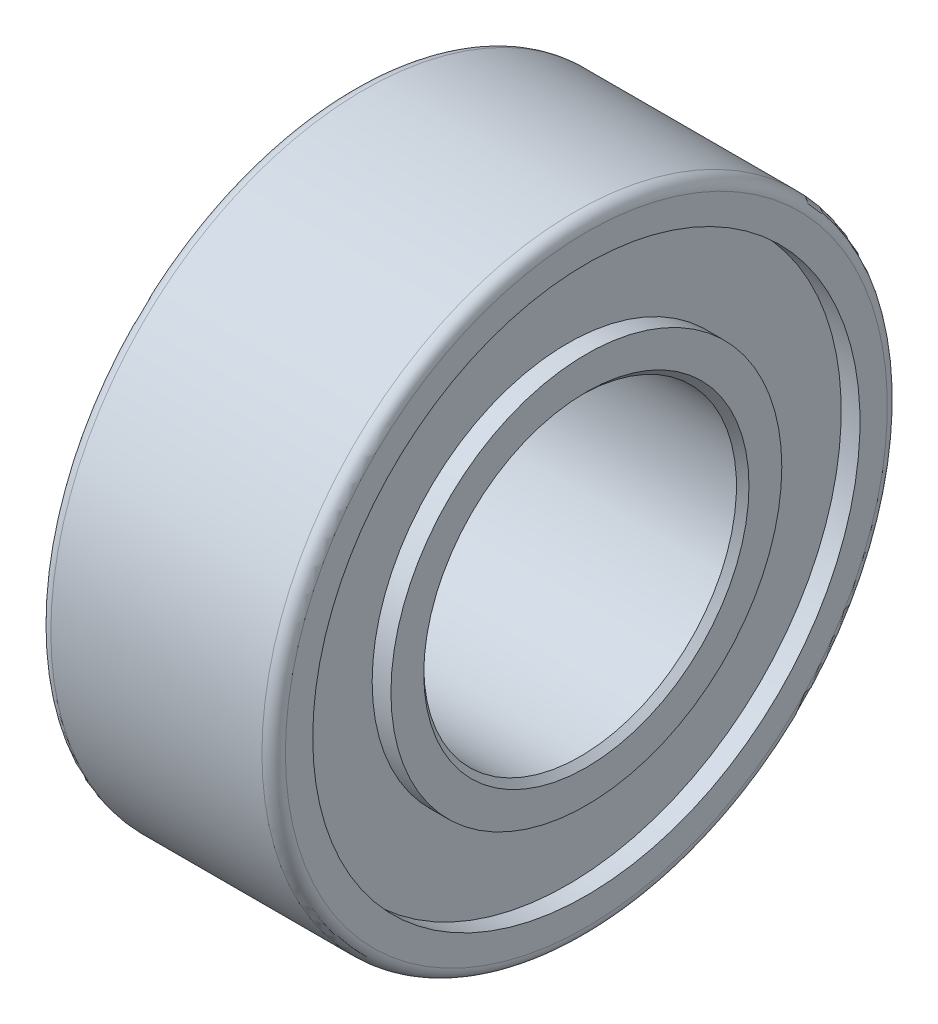
ISO-10303-21;
HEADER;
FILE_DESCRIPTION(('STEP AP214'),'2;1');
FILE_NAME('part.step','',(''),(''),'','','');
FILE_SCHEMA(('AUTOMOTIVE_DESIGN { 1 0 10303 214 1 1 1 1 }'));
ENDSEC;
DATA;
#1=APPLICATION_CONTEXT('core data for automotive mechanical design processes');
#2=APPLICATION_PROTOCOL_DEFINITION('international standard','automotive_design',2000,#1);
#3=PRODUCT_CONTEXT('',#1,'mechanical');
#4=PRODUCT('Part','Part','',(#3));
#5=PRODUCT_RELATED_PRODUCT_CATEGORY('part','',(#4));
#6=PRODUCT_DEFINITION_FORMATION('','',#4);
#7=PRODUCT_DEFINITION_CONTEXT('part definition',#1,'design');
#8=PRODUCT_DEFINITION('design','',#6,#7);
#9=PRODUCT_DEFINITION_SHAPE('','',#8);
#10=(LENGTH_UNIT() NAMED_UNIT(*) SI_UNIT(.MILLI.,.METRE.));
#11=(NAMED_UNIT(*) PLANE_ANGLE_UNIT() SI_UNIT($,.RADIAN.));
#12=(NAMED_UNIT(*) SI_UNIT($,.STERADIAN.) SOLID_ANGLE_UNIT());
#13=UNCERTAINTY_MEASURE_WITH_UNIT(LENGTH_MEASURE(1.E-05),#10,'distance_accuracy_value','');
#14=(GEOMETRIC_REPRESENTATION_CONTEXT(3) GLOBAL_UNCERTAINTY_ASSIGNED_CONTEXT((#13)) GLOBAL_UNIT_ASSIGNED_CONTEXT((#10,
#11,#12)) REPRESENTATION_CONTEXT('',''));
#15=CARTESIAN_POINT('',(0.,0.,0.));
#16=DIRECTION('',(0.,0.,1.));
#17=DIRECTION('',(1.,0.,0.));
#18=AXIS2_PLACEMENT_3D('',#15,#16,#17);
#19=CARTESIAN_POINT('',(2.38125000004175,3.96875,0.));
#20=DIRECTION('',(1.,0.,0.));
#21=DIRECTION('',(0.,0.,-1.));
#22=AXIS2_PLACEMENT_3D('',#19,#20,#21);
#23=PLANE('',#22);
#24=CARTESIAN_POINT('',(2.38125000004175,0.,0.));
#25=DIRECTION('',(-1.,0.,0.));
#26=DIRECTION('',(0.,0.,1.));
#27=AXIS2_PLACEMENT_3D('',#24,#25,#26);
#28=CIRCLE('',#27,3.30200000001923);
#29=CARTESIAN_POINT('',(2.38125000004175,0.,3.30200000001923));
#30=VERTEX_POINT('',#29);
#31=EDGE_CURVE('E10',#30,#30,#28,.T.);
#32=ORIENTED_EDGE('',*,*,#31,.T.);
#33=EDGE_LOOP('',(#32));
#34=FACE_BOUND('',#33,.T.);
#35=CARTESIAN_POINT('',(2.38125000004175,0.,0.));
#36=DIRECTION('',(-1.,0.,0.));
#37=DIRECTION('',(0.,0.,1.));
#38=AXIS2_PLACEMENT_3D('',#35,#36,#37);
#39=CIRCLE('',#38,3.96875);
#40=CARTESIAN_POINT('',(2.38125000004175,0.,3.96875));
#41=VERTEX_POINT('',#40);
#42=EDGE_CURVE('E84',#41,#41,#39,.T.);
#43=ORIENTED_EDGE('',*,*,#42,.F.);
#44=EDGE_LOOP('',(#43));
#45=FACE_BOUND('',#44,.T.);
#46=ADVANCED_FACE('F32',(#34,#45),#23,.T.);
#47=CARTESIAN_POINT('',(2.38125000004175,0.,0.));
#48=DIRECTION('',(1.,0.,0.));
#49=DIRECTION('',(0.,0.,-1.));
#50=AXIS2_PLACEMENT_3D('',#47,#48,#49);
#51=CONICAL_SURFACE('',#50,3.30200000001923,0.785398163397447);
#52=CARTESIAN_POINT('',(2.25425000004975,0.,0.));
#53=DIRECTION('',(-1.,0.,0.));
#54=DIRECTION('',(0.,0.,1.));
#55=AXIS2_PLACEMENT_3D('',#52,#53,#54);
#56=CIRCLE('',#55,3.17500000002724);
#57=CARTESIAN_POINT('',(2.25425000004975,0.,3.17500000002724));
#58=VERTEX_POINT('',#57);
#59=EDGE_CURVE('E38',#58,#58,#56,.T.);
#60=ORIENTED_EDGE('',*,*,#59,.T.);
#61=EDGE_LOOP('',(#60));
#62=FACE_BOUND('',#61,.T.);
#63=ORIENTED_EDGE('',*,*,#31,.F.);
#64=EDGE_LOOP('',(#63));
#65=FACE_BOUND('',#64,.T.);
#66=ADVANCED_FACE('F92',(#62,#65),#51,.F.);
#67=CARTESIAN_POINT('',(2.38250000310324,0.,0.));
#68=DIRECTION('',(-1.,0.,0.));
#69=DIRECTION('',(0.,0.,1.));
#70=AXIS2_PLACEMENT_3D('',#67,#68,#69);
#71=CYLINDRICAL_SURFACE('',#70,3.17500000002724);
#72=CARTESIAN_POINT('',(-2.25424999993606,0.,0.));
#73=DIRECTION('',(-1.,0.,0.));
#74=DIRECTION('',(0.,0.,1.));
#75=AXIS2_PLACEMENT_3D('',#72,#73,#74);
#76=CIRCLE('',#75,3.17500000002724);
#77=CARTESIAN_POINT('',(-2.25424999993606,0.,3.17500000002724));
#78=VERTEX_POINT('',#77);
#79=EDGE_CURVE('E42',#78,#78,#76,.T.);
#80=ORIENTED_EDGE('',*,*,#79,.T.);
#81=EDGE_LOOP('',(#80));
#82=FACE_BOUND('',#81,.T.);
#83=ORIENTED_EDGE('',*,*,#59,.F.);
#84=EDGE_LOOP('',(#83));
#85=FACE_BOUND('',#84,.T.);
#86=ADVANCED_FACE('F96',(#82,#85),#71,.F.);
#87=CARTESIAN_POINT('',(-2.25424999993606,0.,0.));
#88=DIRECTION('',(-1.,0.,0.));
#89=DIRECTION('',(0.,0.,1.));
#90=AXIS2_PLACEMENT_3D('',#87,#88,#89);
#91=CONICAL_SURFACE('',#90,3.17500000002724,0.78539816339745);
#92=CARTESIAN_POINT('',(-2.38124999995648,0.,0.));
#93=DIRECTION('',(-1.,0.,0.));
#94=DIRECTION('',(0.,0.,1.));
#95=AXIS2_PLACEMENT_3D('',#92,#93,#94);
#96=CIRCLE('',#95,3.30200000004766);
#97=CARTESIAN_POINT('',(-2.38124999995648,0.,3.30200000004766));
#98=VERTEX_POINT('',#97);
#99=EDGE_CURVE('E46',#98,#98,#96,.T.);
#100=ORIENTED_EDGE('',*,*,#99,.T.);
#101=EDGE_LOOP('',(#100));
#102=FACE_BOUND('',#101,.T.);
#103=ORIENTED_EDGE('',*,*,#79,.F.);
#104=EDGE_LOOP('',(#103));
#105=FACE_BOUND('',#104,.T.);
#106=ADVANCED_FACE('F100',(#102,#105),#91,.F.);
#107=CARTESIAN_POINT('',(-2.38124999995648,3.30200000004766,0.));
#108=DIRECTION('',(-1.,0.,0.));
#109=DIRECTION('',(0.,0.,1.));
#110=AXIS2_PLACEMENT_3D('',#107,#108,#109);
#111=PLANE('',#110);
#112=CARTESIAN_POINT('',(-2.38124999995648,0.,0.));
#113=DIRECTION('',(-1.,0.,0.));
#114=DIRECTION('',(0.,0.,1.));
#115=AXIS2_PLACEMENT_3D('',#112,#113,#114);
#116=CIRCLE('',#115,3.96875);
#117=CARTESIAN_POINT('',(-2.38124999995648,0.,3.96875));
#118=VERTEX_POINT('',#117);
#119=EDGE_CURVE('E51',#118,#118,#116,.T.);
#120=ORIENTED_EDGE('',*,*,#119,.T.);
#121=EDGE_LOOP('',(#120));
#122=FACE_BOUND('',#121,.T.);
#123=ORIENTED_EDGE('',*,*,#99,.F.);
#124=EDGE_LOOP('',(#123));
#125=FACE_BOUND('',#124,.T.);
#126=ADVANCED_FACE('F107',(#122,#125),#111,.T.);
#127=CARTESIAN_POINT('',(2.38250000310324,0.,0.));
#128=DIRECTION('',(-1.,0.,0.));
#129=DIRECTION('',(0.,0.,1.));
#130=AXIS2_PLACEMENT_3D('',#127,#128,#129);
#131=CYLINDRICAL_SURFACE('',#130,3.96875);
#132=CARTESIAN_POINT('',(-2.00024999995825,0.,0.));
#133=DIRECTION('',(-1.,0.,0.));
#134=DIRECTION('',(0.,0.,1.));
#135=AXIS2_PLACEMENT_3D('',#132,#133,#134);
#136=CIRCLE('',#135,3.96875);
#137=CARTESIAN_POINT('',(-2.00024999995825,0.,3.96875));
#138=VERTEX_POINT('',#137);
#139=EDGE_CURVE('E54',#138,#138,#136,.T.);
#140=ORIENTED_EDGE('',*,*,#139,.T.);
#141=EDGE_LOOP('',(#140));
#142=FACE_BOUND('',#141,.T.);
#143=ORIENTED_EDGE('',*,*,#119,.F.);
#144=EDGE_LOOP('',(#143));
#145=FACE_BOUND('',#144,.T.);
#146=ADVANCED_FACE('F111',(#142,#145),#131,.T.);
#147=CARTESIAN_POINT('',(-2.00024999995825,3.96875,0.));
#148=DIRECTION('',(-1.,0.,0.));
#149=DIRECTION('',(0.,0.,1.));
#150=AXIS2_PLACEMENT_3D('',#147,#148,#149);
#151=PLANE('',#150);
#152=CARTESIAN_POINT('',(-2.00024999995825,0.,0.));
#153=DIRECTION('',(-1.,0.,0.));
#154=DIRECTION('',(0.,0.,1.));
#155=AXIS2_PLACEMENT_3D('',#152,#153,#154);
#156=CIRCLE('',#155,5.55625);
#157=CARTESIAN_POINT('',(-2.00024999995825,0.,5.55625));
#158=VERTEX_POINT('',#157);
#159=EDGE_CURVE('E57',#158,#158,#156,.T.);
#160=ORIENTED_EDGE('',*,*,#159,.T.);
#161=EDGE_LOOP('',(#160));
#162=FACE_BOUND('',#161,.T.);
#163=ORIENTED_EDGE('',*,*,#139,.F.);
#164=EDGE_LOOP('',(#163));
#165=FACE_BOUND('',#164,.T.);
#166=ADVANCED_FACE('F115',(#162,#165),#151,.T.);
#167=CARTESIAN_POINT('',(2.38250000310324,0.,0.));
#168=DIRECTION('',(-1.,0.,0.));
#169=DIRECTION('',(0.,0.,1.));
#170=AXIS2_PLACEMENT_3D('',#167,#168,#169);
#171=CYLINDRICAL_SURFACE('',#170,5.55625);
#172=CARTESIAN_POINT('',(-2.38124999995648,0.,0.));
#173=DIRECTION('',(-1.,0.,0.));
#174=DIRECTION('',(0.,0.,1.));
#175=AXIS2_PLACEMENT_3D('',#172,#173,#174);
#176=CIRCLE('',#175,5.55625);
#177=CARTESIAN_POINT('',(-2.38124999995648,0.,5.55625));
#178=VERTEX_POINT('',#177);
#179=EDGE_CURVE('E60',#178,#178,#176,.T.);
#180=ORIENTED_EDGE('',*,*,#179,.T.);
#181=EDGE_LOOP('',(#180));
#182=FACE_BOUND('',#181,.T.);
#183=ORIENTED_EDGE('',*,*,#159,.F.);
#184=EDGE_LOOP('',(#183));
#185=FACE_BOUND('',#184,.T.);
#186=ADVANCED_FACE('F119',(#182,#185),#171,.F.);
#187=CARTESIAN_POINT('',(-2.38124999995648,5.55625,0.));
#188=DIRECTION('',(-1.,0.,0.));
#189=DIRECTION('',(0.,0.,1.));
#190=AXIS2_PLACEMENT_3D('',#187,#188,#189);
#191=PLANE('',#190);
#192=CARTESIAN_POINT('',(-2.38124999995648,0.,0.));
#193=DIRECTION('',(-1.,0.,0.));
#194=DIRECTION('',(0.,0.,1.));
#195=AXIS2_PLACEMENT_3D('',#192,#193,#194);
#196=CIRCLE('',#195,6.111875);
#197=CARTESIAN_POINT('',(-2.38124999995648,0.,6.111875));
#198=VERTEX_POINT('',#197);
#199=EDGE_CURVE('E63',#198,#198,#196,.T.);
#200=ORIENTED_EDGE('',*,*,#199,.T.);
#201=EDGE_LOOP('',(#200));
#202=FACE_BOUND('',#201,.T.);
#203=ORIENTED_EDGE('',*,*,#179,.F.);
#204=EDGE_LOOP('',(#203));
#205=FACE_BOUND('',#204,.T.);
#206=ADVANCED_FACE('F123',(#202,#205),#191,.T.);
#207=CARTESIAN_POINT('',(-2.14312499995648,0.,0.));
#208=DIRECTION('',(-1.,0.,0.));
#209=DIRECTION('',(0.,0.,1.));
#210=AXIS2_PLACEMENT_3D('',#207,#208,#209);
#211=TOROIDAL_SURFACE('',#210,6.111875,0.238125);
#212=CARTESIAN_POINT('',(-2.14312499995648,0.,0.));
#213=DIRECTION('',(-1.,0.,0.));
#214=DIRECTION('',(0.,0.,1.));
#215=AXIS2_PLACEMENT_3D('',#212,#213,#214);
#216=CIRCLE('',#215,6.35);
#217=CARTESIAN_POINT('',(-2.14312499995648,0.,6.35));
#218=VERTEX_POINT('',#217);
#219=EDGE_CURVE('E66',#218,#218,#216,.T.);
#220=ORIENTED_EDGE('',*,*,#219,.T.);
#221=EDGE_LOOP('',(#220));
#222=FACE_BOUND('',#221,.T.);
#223=ORIENTED_EDGE('',*,*,#199,.F.);
#224=EDGE_LOOP('',(#223));
#225=FACE_BOUND('',#224,.T.);
#226=ADVANCED_FACE('F127',(#222,#225),#211,.T.);
#227=CARTESIAN_POINT('',(2.38250000310324,0.,0.));
#228=DIRECTION('',(-1.,0.,0.));
#229=DIRECTION('',(0.,0.,1.));
#230=AXIS2_PLACEMENT_3D('',#227,#228,#229);
#231=CYLINDRICAL_SURFACE('',#230,6.35);
#232=CARTESIAN_POINT('',(2.14312500004175,0.,0.));
#233=DIRECTION('',(-1.,0.,0.));
#234=DIRECTION('',(0.,0.,1.));
#235=AXIS2_PLACEMENT_3D('',#232,#233,#234);
#236=CIRCLE('',#235,6.35);
#237=CARTESIAN_POINT('',(2.14312500004175,0.,6.35));
#238=VERTEX_POINT('',#237);
#239=EDGE_CURVE('E69',#238,#238,#236,.T.);
#240=ORIENTED_EDGE('',*,*,#239,.T.);
#241=EDGE_LOOP('',(#240));
#242=FACE_BOUND('',#241,.T.);
#243=ORIENTED_EDGE('',*,*,#219,.F.);
#244=EDGE_LOOP('',(#243));
#245=FACE_BOUND('',#244,.T.);
#246=ADVANCED_FACE('F131',(#242,#245),#231,.T.);
#247=CARTESIAN_POINT('',(2.14312500004175,0.,0.));
#248=DIRECTION('',(-1.,0.,0.));
#249=DIRECTION('',(0.,0.,1.));
#250=AXIS2_PLACEMENT_3D('',#247,#248,#249);
#251=TOROIDAL_SURFACE('',#250,6.111875,0.238125);
#252=CARTESIAN_POINT('',(2.38125000004175,0.,0.));
#253=DIRECTION('',(-1.,0.,0.));
#254=DIRECTION('',(0.,0.,1.));
#255=AXIS2_PLACEMENT_3D('',#252,#253,#254);
#256=CIRCLE('',#255,6.111875);
#257=CARTESIAN_POINT('',(2.38125000004175,0.,6.111875));
#258=VERTEX_POINT('',#257);
#259=EDGE_CURVE('E72',#258,#258,#256,.T.);
#260=ORIENTED_EDGE('',*,*,#259,.T.);
#261=EDGE_LOOP('',(#260));
#262=FACE_BOUND('',#261,.T.);
#263=ORIENTED_EDGE('',*,*,#239,.F.);
#264=EDGE_LOOP('',(#263));
#265=FACE_BOUND('',#264,.T.);
#266=ADVANCED_FACE('F135',(#262,#265),#251,.T.);
#267=CARTESIAN_POINT('',(2.38125000004175,6.111875,0.));
#268=DIRECTION('',(1.,0.,0.));
#269=DIRECTION('',(0.,0.,-1.));
#270=AXIS2_PLACEMENT_3D('',#267,#268,#269);
#271=PLANE('',#270);
#272=CARTESIAN_POINT('',(2.38125000004175,0.,0.));
#273=DIRECTION('',(-1.,0.,0.));
#274=DIRECTION('',(0.,0.,1.));
#275=AXIS2_PLACEMENT_3D('',#272,#273,#274);
#276=CIRCLE('',#275,5.55625);
#277=CARTESIAN_POINT('',(2.38125000004175,0.,5.55625));
#278=VERTEX_POINT('',#277);
#279=EDGE_CURVE('E75',#278,#278,#276,.T.);
#280=ORIENTED_EDGE('',*,*,#279,.T.);
#281=EDGE_LOOP('',(#280));
#282=FACE_BOUND('',#281,.T.);
#283=ORIENTED_EDGE('',*,*,#259,.F.);
#284=EDGE_LOOP('',(#283));
#285=FACE_BOUND('',#284,.T.);
#286=ADVANCED_FACE('F139',(#282,#285),#271,.T.);
#287=CARTESIAN_POINT('',(2.38250000310324,0.,0.));
#288=DIRECTION('',(-1.,0.,0.));
#289=DIRECTION('',(0.,0.,1.));
#290=AXIS2_PLACEMENT_3D('',#287,#288,#289);
#291=CYLINDRICAL_SURFACE('',#290,5.55625);
#292=CARTESIAN_POINT('',(2.00025000004175,0.,0.));
#293=DIRECTION('',(-1.,0.,0.));
#294=DIRECTION('',(0.,0.,1.));
#295=AXIS2_PLACEMENT_3D('',#292,#293,#294);
#296=CIRCLE('',#295,5.55625);
#297=CARTESIAN_POINT('',(2.00025000004175,0.,5.55625));
#298=VERTEX_POINT('',#297);
#299=EDGE_CURVE('E78',#298,#298,#296,.T.);
#300=ORIENTED_EDGE('',*,*,#299,.T.);
#301=EDGE_LOOP('',(#300));
#302=FACE_BOUND('',#301,.T.);
#303=ORIENTED_EDGE('',*,*,#279,.F.);
#304=EDGE_LOOP('',(#303));
#305=FACE_BOUND('',#304,.T.);
#306=ADVANCED_FACE('F143',(#302,#305),#291,.F.);
#307=CARTESIAN_POINT('',(2.00025000004175,5.55625,0.));
#308=DIRECTION('',(1.,0.,0.));
#309=DIRECTION('',(0.,0.,-1.));
#310=AXIS2_PLACEMENT_3D('',#307,#308,#309);
#311=PLANE('',#310);
#312=CARTESIAN_POINT('',(2.00025000004175,0.,0.));
#313=DIRECTION('',(-1.,0.,0.));
#314=DIRECTION('',(0.,0.,1.));
#315=AXIS2_PLACEMENT_3D('',#312,#313,#314);
#316=CIRCLE('',#315,3.96875);
#317=CARTESIAN_POINT('',(2.00025000004175,0.,3.96875));
#318=VERTEX_POINT('',#317);
#319=EDGE_CURVE('E81',#318,#318,#316,.T.);
#320=ORIENTED_EDGE('',*,*,#319,.T.);
#321=EDGE_LOOP('',(#320));
#322=FACE_BOUND('',#321,.T.);
#323=ORIENTED_EDGE('',*,*,#299,.F.);
#324=EDGE_LOOP('',(#323));
#325=FACE_BOUND('',#324,.T.);
#326=ADVANCED_FACE('F147',(#322,#325),#311,.T.);
#327=CARTESIAN_POINT('',(2.38250000310324,0.,0.));
#328=DIRECTION('',(-1.,0.,0.));
#329=DIRECTION('',(0.,0.,1.));
#330=AXIS2_PLACEMENT_3D('',#327,#328,#329);
#331=CYLINDRICAL_SURFACE('',#330,3.96875);
#332=ORIENTED_EDGE('',*,*,#42,.T.);
#333=EDGE_LOOP('',(#332));
#334=FACE_BOUND('',#333,.T.);
#335=ORIENTED_EDGE('',*,*,#319,.F.);
#336=EDGE_LOOP('',(#335));
#337=FACE_BOUND('',#336,.T.);
#338=ADVANCED_FACE('F88',(#334,#337),#331,.T.);
#339=CLOSED_SHELL('',(#46,#66,#86,#106,#126,#146,#166,#186,#206,#226,#246,#266,#286,#306,#326,#338));
#340=MANIFOLD_SOLID_BREP('B2',#339);
#341=ADVANCED_BREP_SHAPE_REPRESENTATION('',(#18,#340),#14);
#342=SHAPE_DEFINITION_REPRESENTATION(#9,#341);
ENDSEC;
END-ISO-10303-21;
